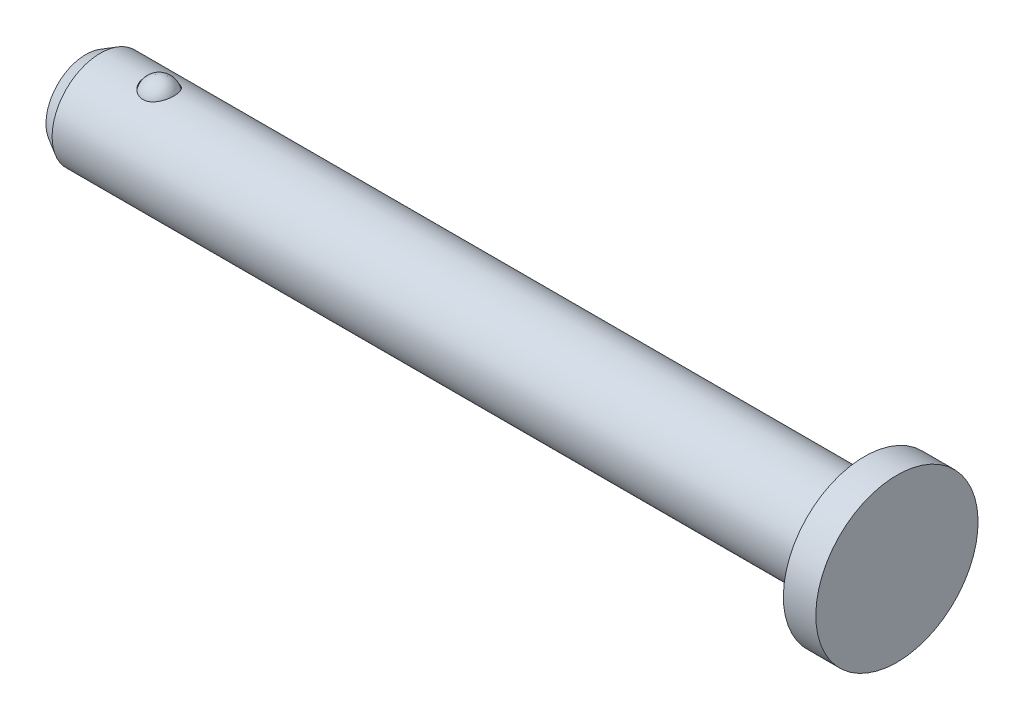
ISO-10303-21;
HEADER;
FILE_DESCRIPTION(('STEP AP214'),'2;1');
FILE_NAME('part.step','',(''),(''),'','','');
FILE_SCHEMA(('AUTOMOTIVE_DESIGN { 1 0 10303 214 1 1 1 1 }'));
ENDSEC;
DATA;
#1=APPLICATION_CONTEXT('core data for automotive mechanical design processes');
#2=APPLICATION_PROTOCOL_DEFINITION('international standard','automotive_design',2000,#1);
#3=PRODUCT_CONTEXT('',#1,'mechanical');
#4=PRODUCT('Part','Part','',(#3));
#5=PRODUCT_RELATED_PRODUCT_CATEGORY('part','',(#4));
#6=PRODUCT_DEFINITION_FORMATION('','',#4);
#7=PRODUCT_DEFINITION_CONTEXT('part definition',#1,'design');
#8=PRODUCT_DEFINITION('design','',#6,#7);
#9=PRODUCT_DEFINITION_SHAPE('','',#8);
#10=(LENGTH_UNIT() NAMED_UNIT(*) SI_UNIT(.MILLI.,.METRE.));
#11=(NAMED_UNIT(*) PLANE_ANGLE_UNIT() SI_UNIT($,.RADIAN.));
#12=(NAMED_UNIT(*) SI_UNIT($,.STERADIAN.) SOLID_ANGLE_UNIT());
#13=UNCERTAINTY_MEASURE_WITH_UNIT(LENGTH_MEASURE(1.E-05),#10,'distance_accuracy_value','');
#14=(GEOMETRIC_REPRESENTATION_CONTEXT(3) GLOBAL_UNCERTAINTY_ASSIGNED_CONTEXT((#13)) GLOBAL_UNIT_ASSIGNED_CONTEXT((#10,
#11,#12)) REPRESENTATION_CONTEXT('',''));
#15=CARTESIAN_POINT('',(0.,0.,0.));
#16=DIRECTION('',(0.,0.,1.));
#17=DIRECTION('',(1.,0.,0.));
#18=AXIS2_PLACEMENT_3D('',#15,#16,#17);
#19=CARTESIAN_POINT('',(-16.26235,2.02985730626251,0.));
#20=DIRECTION('',(-1.,0.,0.));
#21=DIRECTION('',(0.,1.,0.));
#22=AXIS2_PLACEMENT_3D('',#19,#20,#21);
#23=SPHERICAL_SURFACE('',#22,0.789542693737488);
#24=CARTESIAN_POINT('',(-17.0518926937375,2.02985730626251,0.));
#25=VERTEX_POINT('',#24);
#26=VERTEX_LOOP('',#25);
#27=FACE_BOUND('',#26,.T.);
#28=ADVANCED_FACE('F41',(#27),#23,.T.);
#29=CLOSED_SHELL('',(#28));
#30=MANIFOLD_SOLID_BREP('B2',#29);
#31=CARTESIAN_POINT('',(-19.84375,0.,0.));
#32=DIRECTION('',(-1.,0.,0.));
#33=DIRECTION('',(0.,-1.,0.));
#34=AXIS2_PLACEMENT_3D('',#31,#32,#33);
#35=CYLINDRICAL_SURFACE('',#34,2.3622);
#36=CARTESIAN_POINT('',(-19.13509,0.,0.));
#37=DIRECTION('',(-1.,0.,0.));
#38=DIRECTION('',(0.,-1.,0.));
#39=AXIS2_PLACEMENT_3D('',#36,#37,#38);
#40=CIRCLE('',#39,2.3622);
#41=CARTESIAN_POINT('',(-19.13509,-2.3622,0.));
#42=VERTEX_POINT('',#41);
#43=EDGE_CURVE('E65',#42,#42,#40,.T.);
#44=ORIENTED_EDGE('',*,*,#43,.F.);
#45=EDGE_LOOP('',(#44));
#46=FACE_BOUND('',#45,.T.);
#47=CARTESIAN_POINT('',(18.25625,0.,0.));
#48=DIRECTION('',(-1.,0.,0.));
#49=DIRECTION('',(0.,-1.,0.));
#50=AXIS2_PLACEMENT_3D('',#47,#48,#49);
#51=CIRCLE('',#50,2.3622);
#52=CARTESIAN_POINT('',(18.25625,-2.3622,0.));
#53=VERTEX_POINT('',#52);
#54=EDGE_CURVE('E40',#53,#53,#51,.T.);
#55=ORIENTED_EDGE('',*,*,#54,.T.);
#56=EDGE_LOOP('',(#55));
#57=FACE_BOUND('',#56,.T.);
#58=CARTESIAN_POINT('',(-16.26235,2.22581604673215,-0.791032089178223));
#59=CARTESIAN_POINT('',(-16.3018338222643,2.22581576398311,-0.791032519638611));
#60=CARTESIAN_POINT('',(-16.3413151384197,2.22697971671572,-0.787780239460781));
#61=CARTESIAN_POINT('',(-16.4190911852111,2.23149491079169,-0.774896744356571));
#62=CARTESIAN_POINT('',(-16.4573858392533,2.2348462930174,-0.765265118565097));
#63=CARTESIAN_POINT('',(-16.531633713184,2.24333848583653,-0.739997800068514));
#64=CARTESIAN_POINT('',(-16.5675913296129,2.24847581373636,-0.724373786774371));
#65=CARTESIAN_POINT('',(-16.6363604141592,2.25998083212617,-0.687636848342251));
#66=CARTESIAN_POINT('',(-16.6691713829049,2.26634871742328,-0.666523053944659));
#67=CARTESIAN_POINT('',(-16.7319315200548,2.27988127975237,-0.618680689218364));
#68=CARTESIAN_POINT('',(-16.7617565640189,2.28706485050395,-0.591794972427997));
#69=CARTESIAN_POINT('',(-16.8167458077474,2.30133787147743,-0.533600878356361));
#70=CARTESIAN_POINT('',(-16.8419088865026,2.30842729868224,-0.502291440535601));
#71=CARTESIAN_POINT('',(-16.88866080437,2.32229610981989,-0.433849997368858));
#72=CARTESIAN_POINT('',(-16.9099016466427,2.32902369976236,-0.396469482014573));
#73=CARTESIAN_POINT('',(-16.9462545129409,2.34094584755715,-0.318610784362622));
#74=CARTESIAN_POINT('',(-16.9613651181152,2.34614005042941,-0.278131887514646));
#75=CARTESIAN_POINT('',(-16.9857004779035,2.35466270542611,-0.193473280151713));
#76=CARTESIAN_POINT('',(-16.9946653937695,2.35790814356074,-0.149210288520306));
#77=CARTESIAN_POINT('',(-17.005565894284,2.36186996349137,-0.0597154884593794));
#78=CARTESIAN_POINT('',(-17.0075008699652,2.36258612618922,-0.0144835964404185));
#79=CARTESIAN_POINT('',(-17.0042909971991,2.36141021290238,0.0762430533264951));
#80=CARTESIAN_POINT('',(-16.9990605263757,2.35948659277288,0.121734407393892));
#81=CARTESIAN_POINT('',(-16.9814508372294,2.35317206611294,0.211137527329617));
#82=CARTESIAN_POINT('',(-16.9690713024393,2.34878105035866,0.255049223179882));
#83=CARTESIAN_POINT('',(-16.9373785333382,2.33799474034002,0.340003755419018));
#84=CARTESIAN_POINT('',(-16.9180697195014,2.33160072420233,0.381048400920879));
#85=CARTESIAN_POINT('',(-16.8728542738949,2.31749884585933,0.45908762846867));
#86=CARTESIAN_POINT('',(-16.8469476298871,2.30979098121703,0.49608220300213));
#87=CARTESIAN_POINT('',(-16.7895191404422,2.2940716483114,0.564297213422602));
#88=CARTESIAN_POINT('',(-16.7580957761656,2.28606718272386,0.595601988346434));
#89=CARTESIAN_POINT('',(-16.6900563583582,2.27059247122217,0.652119197807015));
#90=CARTESIAN_POINT('',(-16.6534418764304,2.26312206464838,0.677333470010342));
#91=CARTESIAN_POINT('',(-16.5779492741709,2.25001785060625,0.71963628712746));
#92=CARTESIAN_POINT('',(-16.5392775456061,2.24431058256401,0.737069660996988));
#93=CARTESIAN_POINT('',(-16.4592512672778,2.23497292980211,0.764920542936362));
#94=CARTESIAN_POINT('',(-16.4178981594483,2.23134143896186,0.775341788088755));
#95=CARTESIAN_POINT('',(-16.336791790642,2.22680429519513,0.788273335332939));
#96=CARTESIAN_POINT('',(-16.2971273529941,2.2257265947787,0.791283526133024));
#97=CARTESIAN_POINT('',(-16.2178529464748,2.2259171339851,0.790747912230158));
#98=CARTESIAN_POINT('',(-16.1782429675224,2.227184856437,0.787203552820129));
#99=CARTESIAN_POINT('',(-16.101593807461,2.23183155461559,0.773926866318529));
#100=CARTESIAN_POINT('',(-16.0645129744794,2.23513795566731,0.764407057193664));
#101=CARTESIAN_POINT('',(-15.9924941222932,2.24343404277332,0.739703383423264));
#102=CARTESIAN_POINT('',(-15.9575563106065,2.24842389153994,0.724518971254892));
#103=CARTESIAN_POINT('',(-15.8896511257475,2.25973866548061,0.688430400089751));
#104=CARTESIAN_POINT('',(-15.8567728995766,2.26609879126542,0.667369988967335));
#105=CARTESIAN_POINT('',(-15.7948539005421,2.27941389290418,0.620368260180016));
#106=CARTESIAN_POINT('',(-15.7658141812176,2.28636903120949,0.594425607222326));
#107=CARTESIAN_POINT('',(-15.7103363875522,2.30067315029258,0.53650441012868));
#108=CARTESIAN_POINT('',(-15.6841940827522,2.30801802589022,0.504241497413388));
#109=CARTESIAN_POINT('',(-15.6373294223548,2.3219066096982,0.435840003810781));
#110=CARTESIAN_POINT('',(-15.6166085654881,2.32845009610334,0.399700355105055));
#111=CARTESIAN_POINT('',(-15.5799154074514,2.34044485511105,0.32236581590907));
#112=CARTESIAN_POINT('',(-15.5642733166028,2.34581462134006,0.281001264451537));
#113=CARTESIAN_POINT('',(-15.5396525932013,2.35443088539652,0.19612297154861));
#114=CARTESIAN_POINT('',(-15.5306749478103,2.35767706866266,0.152608912728052));
#115=CARTESIAN_POINT('',(-15.5193857562819,2.36177692867522,0.0635170638966755));
#116=CARTESIAN_POINT('',(-15.5172440137684,2.36256964717617,0.017914843369445));
#117=CARTESIAN_POINT('',(-15.520139881845,2.3615088375365,-0.0730313594257119));
#118=CARTESIAN_POINT('',(-15.5251778997728,2.35965515925471,-0.118375326895324));
#119=CARTESIAN_POINT('',(-15.5423917858139,2.35347668943244,-0.20772830543412));
#120=CARTESIAN_POINT('',(-15.5545996260354,2.34914083140647,-0.251730402335729));
#121=CARTESIAN_POINT('',(-15.5859777734291,2.33844323829137,-0.33692140450069));
#122=CARTESIAN_POINT('',(-15.6051483348,2.33208142923882,-0.378110206989595));
#123=CARTESIAN_POINT('',(-15.6499743354645,2.31806542607961,-0.45620965136972));
#124=CARTESIAN_POINT('',(-15.6755888264204,2.31041949036449,-0.49314523746102));
#125=CARTESIAN_POINT('',(-15.7328670809521,2.29467177360045,-0.561885478042449));
#126=CARTESIAN_POINT('',(-15.7645302727704,2.28657003568757,-0.593690616967873));
#127=CARTESIAN_POINT('',(-15.8321103675284,2.27114006586694,-0.65018826947417));
#128=CARTESIAN_POINT('',(-15.8678630627565,2.26379555842983,-0.675072287191635));
#129=CARTESIAN_POINT('',(-15.9434509291089,2.25051576769323,-0.718107031490447));
#130=CARTESIAN_POINT('',(-15.9832838483709,2.24457971300892,-0.736261446834665));
#131=CARTESIAN_POINT('',(-16.0625351985796,2.23529527948482,-0.763964093369265));
#132=CARTESIAN_POINT('',(-16.1017351816544,2.2317787962283,-0.774081433169419));
#133=CARTESIAN_POINT('',(-16.1814079558051,2.22703972798425,-0.787614032349746));
#134=CARTESIAN_POINT('',(-16.221880294314,2.22581633654123,-0.791031647969541));
#135=CARTESIAN_POINT('',(-16.26235,2.22581604673215,-0.791032089178223));
#136=B_SPLINE_CURVE_WITH_KNOTS('',3,(#58,#59,#60,#61,#62,#63,#64,#65,#66,#67,#68,#69,#70,#71,
#72,#73,#74,#75,#76,#77,#78,#79,#80,#81,#82,#83,#84,#85,#86,#87,#88,#89,#90,#91,#92,#93,#94,#95,
#96,#97,#98,#99,#100,#101,#102,#103,#104,#105,#106,#107,#108,#109,#110,#111,#112,#113,#114,#115,
#116,#117,#118,#119,#120,#121,#122,#123,#124,#125,#126,#127,#128,#129,#130,#131,#132,#133,#134,
#135),.UNSPECIFIED.,.T.,.F.,(4,2,2,2,2,2,2,2,2,2,2,2,2,2,2,2,2,2,2,2,2,2,2,2,2,2,2,2,2,2,2,2,2,
2,2,2,2,2,4),(0.,0.118299361509042,0.23660634289136,0.354683901324836,0.472780167721935,
0.594630449676355,0.71650999364796,0.846477480289193,0.976475030932804,1.1116766565592,
1.24688999372125,1.38373321192028,1.52058248821508,1.65734461742628,1.79410700031297,
1.92863866932186,2.06312969570308,2.19085824756083,2.31851867302865,2.43729849240827,
2.55605212369601,2.6708045306772,2.78556803214263,2.90373452362426,3.02193338072497,
3.14788853933123,3.27387848087818,3.40691156896659,3.53996435847092,3.67629744685247,
3.81263827028837,3.94959173936421,4.08655020891101,4.22265943045033,4.35875579253439,
4.49059132495187,4.62235448583304,4.74365036609798,4.86490357990958),.UNSPECIFIED.);
#137=CARTESIAN_POINT('',(-16.26235,2.22581604673215,-0.791032089178223));
#138=VERTEX_POINT('',#137);
#139=EDGE_CURVE('E57',#138,#138,#136,.T.);
#140=ORIENTED_EDGE('',*,*,#139,.F.);
#141=EDGE_LOOP('',(#140));
#142=FACE_BOUND('',#141,.T.);
#143=ADVANCED_FACE('F53',(#46,#57,#142),#35,.T.);
#144=CARTESIAN_POINT('',(18.25625,2.3622,0.));
#145=DIRECTION('',(1.,0.,0.));
#146=DIRECTION('',(0.,1.,0.));
#147=AXIS2_PLACEMENT_3D('',#144,#145,#146);
#148=PLANE('',#147);
#149=ORIENTED_EDGE('',*,*,#54,.F.);
#150=EDGE_LOOP('',(#149));
#151=FACE_BOUND('',#150,.T.);
#152=CARTESIAN_POINT('',(18.25625,0.,0.));
#153=DIRECTION('',(-1.,0.,0.));
#154=DIRECTION('',(0.,-1.,0.));
#155=AXIS2_PLACEMENT_3D('',#152,#153,#154);
#156=CIRCLE('',#155,3.96874999999999);
#157=CARTESIAN_POINT('',(18.25625,-3.96874999999999,0.));
#158=VERTEX_POINT('',#157);
#159=EDGE_CURVE('E77',#158,#158,#156,.T.);
#160=ORIENTED_EDGE('',*,*,#159,.T.);
#161=EDGE_LOOP('',(#160));
#162=FACE_BOUND('',#161,.T.);
#163=ADVANCED_FACE('F55',(#151,#162),#148,.F.);
#164=CARTESIAN_POINT('',(-19.13509,0.,0.));
#165=DIRECTION('',(1.,0.,0.));
#166=DIRECTION('',(0.,1.,0.));
#167=AXIS2_PLACEMENT_3D('',#164,#165,#166);
#168=CONICAL_SURFACE('',#167,2.3622,0.523598775598301);
#169=CARTESIAN_POINT('',(-19.84375,0.,0.));
#170=DIRECTION('',(-1.,0.,0.));
#171=DIRECTION('',(0.,-1.,0.));
#172=AXIS2_PLACEMENT_3D('',#169,#170,#171);
#173=CIRCLE('',#172,1.95305495823607);
#174=CARTESIAN_POINT('',(-19.84375,-1.95305495823607,0.));
#175=VERTEX_POINT('',#174);
#176=EDGE_CURVE('E69',#175,#175,#173,.T.);
#177=ORIENTED_EDGE('',*,*,#176,.F.);
#178=EDGE_LOOP('',(#177));
#179=FACE_BOUND('',#178,.T.);
#180=ORIENTED_EDGE('',*,*,#43,.T.);
#181=EDGE_LOOP('',(#180));
#182=FACE_BOUND('',#181,.T.);
#183=ADVANCED_FACE('F91',(#179,#182),#168,.T.);
#184=CARTESIAN_POINT('',(-19.84375,1.95305495823607,0.));
#185=DIRECTION('',(1.,0.,0.));
#186=DIRECTION('',(0.,1.,0.));
#187=AXIS2_PLACEMENT_3D('',#184,#185,#186);
#188=PLANE('',#187);
#189=ORIENTED_EDGE('',*,*,#176,.T.);
#190=EDGE_LOOP('',(#189));
#191=FACE_BOUND('',#190,.T.);
#192=ADVANCED_FACE('F98',(#191),#188,.F.);
#193=CARTESIAN_POINT('',(19.84375,3.96874999999999,0.));
#194=DIRECTION('',(-1.,0.,0.));
#195=DIRECTION('',(0.,-1.,0.));
#196=AXIS2_PLACEMENT_3D('',#193,#194,#195);
#197=PLANE('',#196);
#198=CARTESIAN_POINT('',(19.84375,0.,0.));
#199=DIRECTION('',(-1.,0.,0.));
#200=DIRECTION('',(0.,-1.,0.));
#201=AXIS2_PLACEMENT_3D('',#198,#199,#200);
#202=CIRCLE('',#201,3.96874999999999);
#203=CARTESIAN_POINT('',(19.84375,-3.96874999999999,0.));
#204=VERTEX_POINT('',#203);
#205=EDGE_CURVE('E74',#204,#204,#202,.T.);
#206=ORIENTED_EDGE('',*,*,#205,.F.);
#207=EDGE_LOOP('',(#206));
#208=FACE_BOUND('',#207,.T.);
#209=ADVANCED_FACE('F102',(#208),#197,.F.);
#210=CARTESIAN_POINT('',(-19.84375,0.,0.));
#211=DIRECTION('',(-1.,0.,0.));
#212=DIRECTION('',(0.,-1.,0.));
#213=AXIS2_PLACEMENT_3D('',#210,#211,#212);
#214=CYLINDRICAL_SURFACE('',#213,3.96874999999999);
#215=ORIENTED_EDGE('',*,*,#159,.F.);
#216=EDGE_LOOP('',(#215));
#217=FACE_BOUND('',#216,.T.);
#218=ORIENTED_EDGE('',*,*,#205,.T.);
#219=EDGE_LOOP('',(#218));
#220=FACE_BOUND('',#219,.T.);
#221=ADVANCED_FACE('F106',(#217,#220),#214,.T.);
#222=CARTESIAN_POINT('',(-16.26235,2.02985730626251,0.));
#223=DIRECTION('',(-1.,0.,0.));
#224=DIRECTION('',(0.,1.,0.));
#225=AXIS2_PLACEMENT_3D('',#222,#223,#224);
#226=SPHERICAL_SURFACE('',#225,0.814942693737488);
#227=ORIENTED_EDGE('',*,*,#139,.T.);
#228=EDGE_LOOP('',(#227));
#229=FACE_BOUND('',#228,.T.);
#230=ADVANCED_FACE('F84',(#229),#226,.F.);
#231=CLOSED_SHELL('',(#143,#163,#183,#192,#209,#221,#230));
#232=MANIFOLD_SOLID_BREP('B6',#231);
#233=ADVANCED_BREP_SHAPE_REPRESENTATION('',(#18,#30,#232),#14);
#234=SHAPE_DEFINITION_REPRESENTATION(#9,#233);
ENDSEC;
END-ISO-10303-21;
